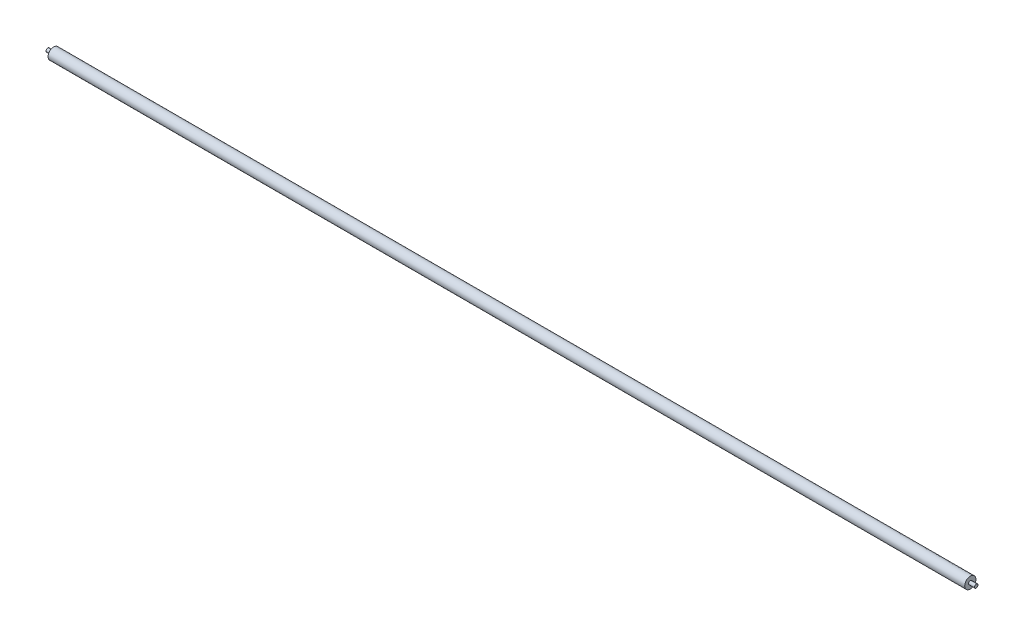
ISO-10303-21;
HEADER;
FILE_DESCRIPTION(('STEP AP214'),'2;1');
FILE_NAME('part.step','',(''),(''),'','','');
FILE_SCHEMA(('AUTOMOTIVE_DESIGN { 1 0 10303 214 1 1 1 1 }'));
ENDSEC;
DATA;
#1=APPLICATION_CONTEXT('core data for automotive mechanical design processes');
#2=APPLICATION_PROTOCOL_DEFINITION('international standard','automotive_design',2000,#1);
#3=PRODUCT_CONTEXT('',#1,'mechanical');
#4=PRODUCT('Part','Part','',(#3));
#5=PRODUCT_RELATED_PRODUCT_CATEGORY('part','',(#4));
#6=PRODUCT_DEFINITION_FORMATION('','',#4);
#7=PRODUCT_DEFINITION_CONTEXT('part definition',#1,'design');
#8=PRODUCT_DEFINITION('design','',#6,#7);
#9=PRODUCT_DEFINITION_SHAPE('','',#8);
#10=(LENGTH_UNIT() NAMED_UNIT(*) SI_UNIT(.MILLI.,.METRE.));
#11=(NAMED_UNIT(*) PLANE_ANGLE_UNIT() SI_UNIT($,.RADIAN.));
#12=(NAMED_UNIT(*) SI_UNIT($,.STERADIAN.) SOLID_ANGLE_UNIT());
#13=UNCERTAINTY_MEASURE_WITH_UNIT(LENGTH_MEASURE(1.E-05),#10,'distance_accuracy_value','');
#14=(GEOMETRIC_REPRESENTATION_CONTEXT(3) GLOBAL_UNCERTAINTY_ASSIGNED_CONTEXT((#13)) GLOBAL_UNIT_ASSIGNED_CONTEXT((#10,
#11,#12)) REPRESENTATION_CONTEXT('',''));
#15=CARTESIAN_POINT('',(0.,0.,0.));
#16=DIRECTION('',(0.,0.,1.));
#17=DIRECTION('',(1.,0.,0.));
#18=AXIS2_PLACEMENT_3D('',#15,#16,#17);
#19=CARTESIAN_POINT('',(1554.,0.,0.));
#20=DIRECTION('',(-1.,0.,0.));
#21=DIRECTION('',(0.,0.,1.));
#22=AXIS2_PLACEMENT_3D('',#19,#20,#21);
#23=CYLINDRICAL_SURFACE('',#22,9.5);
#24=CARTESIAN_POINT('',(1554.,0.,0.));
#25=DIRECTION('',(1.,0.,0.));
#26=DIRECTION('',(0.,0.,-1.));
#27=AXIS2_PLACEMENT_3D('',#24,#25,#26);
#28=CIRCLE('',#27,9.5);
#29=CARTESIAN_POINT('',(1554.,0.,-9.5));
#30=VERTEX_POINT('',#29);
#31=EDGE_CURVE('E48',#30,#30,#28,.T.);
#32=ORIENTED_EDGE('',*,*,#31,.F.);
#33=EDGE_LOOP('',(#32));
#34=FACE_BOUND('',#33,.T.);
#35=CARTESIAN_POINT('',(0.,0.,0.));
#36=DIRECTION('',(1.,0.,0.));
#37=DIRECTION('',(0.,0.,-1.));
#38=AXIS2_PLACEMENT_3D('',#35,#36,#37);
#39=CIRCLE('',#38,9.5);
#40=CARTESIAN_POINT('',(0.,0.,-9.5));
#41=VERTEX_POINT('',#40);
#42=EDGE_CURVE('E39',#41,#41,#39,.T.);
#43=ORIENTED_EDGE('',*,*,#42,.T.);
#44=EDGE_LOOP('',(#43));
#45=FACE_BOUND('',#44,.T.);
#46=ADVANCED_FACE('F36',(#34,#45),#23,.T.);
#47=CARTESIAN_POINT('',(1554.,0.,0.));
#48=DIRECTION('',(1.,0.,0.));
#49=DIRECTION('',(0.,0.,-1.));
#50=AXIS2_PLACEMENT_3D('',#47,#48,#49);
#51=PLANE('',#50);
#52=CARTESIAN_POINT('',(1554.,0.,0.));
#53=DIRECTION('',(1.,0.,0.));
#54=DIRECTION('',(0.,0.,-1.));
#55=AXIS2_PLACEMENT_3D('',#52,#53,#54);
#56=CIRCLE('',#55,3.);
#57=CARTESIAN_POINT('',(1554.,0.,-3.));
#58=VERTEX_POINT('',#57);
#59=EDGE_CURVE('E10',#58,#58,#56,.T.);
#60=ORIENTED_EDGE('',*,*,#59,.F.);
#61=EDGE_LOOP('',(#60));
#62=FACE_BOUND('',#61,.T.);
#63=ORIENTED_EDGE('',*,*,#31,.T.);
#64=EDGE_LOOP('',(#63));
#65=FACE_BOUND('',#64,.T.);
#66=ADVANCED_FACE('F65',(#62,#65),#51,.T.);
#67=CARTESIAN_POINT('',(0.,0.,0.));
#68=DIRECTION('',(1.,0.,0.));
#69=DIRECTION('',(0.,0.,-1.));
#70=AXIS2_PLACEMENT_3D('',#67,#68,#69);
#71=PLANE('',#70);
#72=CARTESIAN_POINT('',(0.,0.,0.));
#73=DIRECTION('',(-1.,0.,0.));
#74=DIRECTION('',(0.,0.,1.));
#75=AXIS2_PLACEMENT_3D('',#72,#73,#74);
#76=CIRCLE('',#75,3.);
#77=CARTESIAN_POINT('',(0.,0.,3.));
#78=VERTEX_POINT('',#77);
#79=EDGE_CURVE('E43',#78,#78,#76,.T.);
#80=ORIENTED_EDGE('',*,*,#79,.F.);
#81=EDGE_LOOP('',(#80));
#82=FACE_BOUND('',#81,.T.);
#83=ORIENTED_EDGE('',*,*,#42,.F.);
#84=EDGE_LOOP('',(#83));
#85=FACE_BOUND('',#84,.T.);
#86=ADVANCED_FACE('F62',(#82,#85),#71,.F.);
#87=CARTESIAN_POINT('',(-10.,0.,0.));
#88=DIRECTION('',(1.,0.,0.));
#89=DIRECTION('',(0.,0.,-1.));
#90=AXIS2_PLACEMENT_3D('',#87,#88,#89);
#91=CYLINDRICAL_SURFACE('',#90,3.);
#92=CARTESIAN_POINT('',(-10.,0.,0.));
#93=DIRECTION('',(-1.,0.,0.));
#94=DIRECTION('',(0.,0.,1.));
#95=AXIS2_PLACEMENT_3D('',#92,#93,#94);
#96=CIRCLE('',#95,3.);
#97=CARTESIAN_POINT('',(-10.,0.,3.));
#98=VERTEX_POINT('',#97);
#99=EDGE_CURVE('E53',#98,#98,#96,.T.);
#100=ORIENTED_EDGE('',*,*,#99,.F.);
#101=EDGE_LOOP('',(#100));
#102=FACE_BOUND('',#101,.T.);
#103=ORIENTED_EDGE('',*,*,#79,.T.);
#104=EDGE_LOOP('',(#103));
#105=FACE_BOUND('',#104,.T.);
#106=ADVANCED_FACE('F64',(#102,#105),#91,.T.);
#107=CARTESIAN_POINT('',(-10.,0.,0.));
#108=DIRECTION('',(-1.,0.,0.));
#109=DIRECTION('',(0.,0.,1.));
#110=AXIS2_PLACEMENT_3D('',#107,#108,#109);
#111=PLANE('',#110);
#112=ORIENTED_EDGE('',*,*,#99,.T.);
#113=EDGE_LOOP('',(#112));
#114=FACE_BOUND('',#113,.T.);
#115=ADVANCED_FACE('F71',(#114),#111,.T.);
#116=CARTESIAN_POINT('',(1564.,0.,0.));
#117=DIRECTION('',(-1.,0.,0.));
#118=DIRECTION('',(0.,0.,1.));
#119=AXIS2_PLACEMENT_3D('',#116,#117,#118);
#120=CYLINDRICAL_SURFACE('',#119,3.);
#121=CARTESIAN_POINT('',(1564.,0.,0.));
#122=DIRECTION('',(1.,0.,0.));
#123=DIRECTION('',(0.,0.,-1.));
#124=AXIS2_PLACEMENT_3D('',#121,#122,#123);
#125=CIRCLE('',#124,3.);
#126=CARTESIAN_POINT('',(1564.,0.,-3.));
#127=VERTEX_POINT('',#126);
#128=EDGE_CURVE('E52',#127,#127,#125,.T.);
#129=ORIENTED_EDGE('',*,*,#128,.F.);
#130=EDGE_LOOP('',(#129));
#131=FACE_BOUND('',#130,.T.);
#132=ORIENTED_EDGE('',*,*,#59,.T.);
#133=EDGE_LOOP('',(#132));
#134=FACE_BOUND('',#133,.T.);
#135=ADVANCED_FACE('F96',(#131,#134),#120,.T.);
#136=CARTESIAN_POINT('',(1564.,0.,0.));
#137=DIRECTION('',(1.,0.,0.));
#138=DIRECTION('',(0.,0.,-1.));
#139=AXIS2_PLACEMENT_3D('',#136,#137,#138);
#140=PLANE('',#139);
#141=ORIENTED_EDGE('',*,*,#128,.T.);
#142=EDGE_LOOP('',(#141));
#143=FACE_BOUND('',#142,.T.);
#144=ADVANCED_FACE('F101',(#143),#140,.T.);
#145=CLOSED_SHELL('',(#46,#66,#86,#106,#115,#135,#144));
#146=MANIFOLD_SOLID_BREP('B2',#145);
#147=ADVANCED_BREP_SHAPE_REPRESENTATION('',(#18,#146),#14);
#148=SHAPE_DEFINITION_REPRESENTATION(#9,#147);
ENDSEC;
END-ISO-10303-21;
